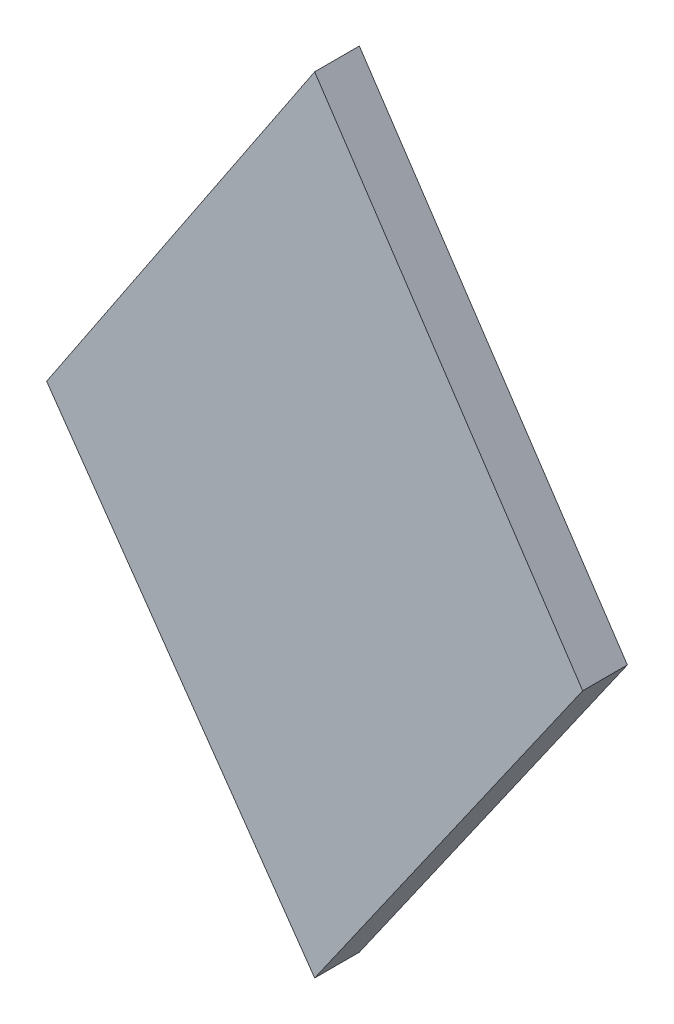
ISO-10303-21;
HEADER;
FILE_DESCRIPTION(('STEP AP214'),'2;1');
FILE_NAME('part.step','',(''),(''),'','','');
FILE_SCHEMA(('AUTOMOTIVE_DESIGN { 1 0 10303 214 1 1 1 1 }'));
ENDSEC;
DATA;
#1=APPLICATION_CONTEXT('core data for automotive mechanical design processes');
#2=APPLICATION_PROTOCOL_DEFINITION('international standard','automotive_design',2000,#1);
#3=PRODUCT_CONTEXT('',#1,'mechanical');
#4=PRODUCT('Part','Part','',(#3));
#5=PRODUCT_RELATED_PRODUCT_CATEGORY('part','',(#4));
#6=PRODUCT_DEFINITION_FORMATION('','',#4);
#7=PRODUCT_DEFINITION_CONTEXT('part definition',#1,'design');
#8=PRODUCT_DEFINITION('design','',#6,#7);
#9=PRODUCT_DEFINITION_SHAPE('','',#8);
#10=(LENGTH_UNIT() NAMED_UNIT(*) SI_UNIT(.MILLI.,.METRE.));
#11=(NAMED_UNIT(*) PLANE_ANGLE_UNIT() SI_UNIT($,.RADIAN.));
#12=(NAMED_UNIT(*) SI_UNIT($,.STERADIAN.) SOLID_ANGLE_UNIT());
#13=UNCERTAINTY_MEASURE_WITH_UNIT(LENGTH_MEASURE(1.E-05),#10,'distance_accuracy_value','');
#14=(GEOMETRIC_REPRESENTATION_CONTEXT(3) GLOBAL_UNCERTAINTY_ASSIGNED_CONTEXT((#13)) GLOBAL_UNIT_ASSIGNED_CONTEXT((#10,
#11,#12)) REPRESENTATION_CONTEXT('',''));
#15=CARTESIAN_POINT('',(0.,0.,0.));
#16=DIRECTION('',(0.,0.,1.));
#17=DIRECTION('',(1.,0.,0.));
#18=AXIS2_PLACEMENT_3D('',#15,#16,#17);
#19=CARTESIAN_POINT('',(-30.,0.,5.));
#20=DIRECTION('',(0.832050294337844,-0.554700196225229,0.));
#21=DIRECTION('',(0.554700196225229,0.832050294337844,0.));
#22=AXIS2_PLACEMENT_3D('',#19,#20,#21);
#23=PLANE('',#22);
#24=DIRECTION('',(-0.554700196225229,-0.832050294337844,0.));
#25=VECTOR('',#24,1.);
#26=CARTESIAN_POINT('',(-30.,0.,0.));
#27=LINE('',#26,#25);
#28=CARTESIAN_POINT('',(0.,45.,0.));
#29=VERTEX_POINT('',#28);
#30=CARTESIAN_POINT('',(-30.,0.,0.));
#31=VERTEX_POINT('',#30);
#32=EDGE_CURVE('E96',#29,#31,#27,.T.);
#33=ORIENTED_EDGE('',*,*,#32,.T.);
#34=DIRECTION('',(0.,0.,-1.));
#35=VECTOR('',#34,1.);
#36=CARTESIAN_POINT('',(-30.,0.,5.));
#37=LINE('',#36,#35);
#38=CARTESIAN_POINT('',(-30.,0.,5.));
#39=VERTEX_POINT('',#38);
#40=EDGE_CURVE('E11',#39,#31,#37,.T.);
#41=ORIENTED_EDGE('',*,*,#40,.F.);
#42=DIRECTION('',(-0.554700196225229,-0.832050294337844,0.));
#43=VECTOR('',#42,1.);
#44=CARTESIAN_POINT('',(-30.,0.,5.));
#45=LINE('',#44,#43);
#46=CARTESIAN_POINT('',(0.,45.,5.));
#47=VERTEX_POINT('',#46);
#48=EDGE_CURVE('E84',#47,#39,#45,.T.);
#49=ORIENTED_EDGE('',*,*,#48,.F.);
#50=DIRECTION('',(0.,0.,-1.));
#51=VECTOR('',#50,1.);
#52=CARTESIAN_POINT('',(0.,45.,5.));
#53=LINE('',#52,#51);
#54=EDGE_CURVE('E92',#47,#29,#53,.T.);
#55=ORIENTED_EDGE('',*,*,#54,.T.);
#56=EDGE_LOOP('',(#33,#41,#49,#55));
#57=FACE_BOUND('',#56,.T.);
#58=ADVANCED_FACE('F33',(#57),#23,.F.);
#59=CARTESIAN_POINT('',(0.,-42.8444402022637,5.));
#60=DIRECTION('',(0.819152044288993,0.573576436351044,0.));
#61=DIRECTION('',(-0.573576436351044,0.819152044288993,0.));
#62=AXIS2_PLACEMENT_3D('',#59,#60,#61);
#63=PLANE('',#62);
#64=DIRECTION('',(0.573576436351044,-0.819152044288993,0.));
#65=VECTOR('',#64,1.);
#66=CARTESIAN_POINT('',(0.,-42.8444402022637,0.));
#67=LINE('',#66,#65);
#68=CARTESIAN_POINT('',(0.,-42.8444402022637,0.));
#69=VERTEX_POINT('',#68);
#70=EDGE_CURVE('E88',#31,#69,#67,.T.);
#71=ORIENTED_EDGE('',*,*,#70,.T.);
#72=DIRECTION('',(0.,0.,-1.));
#73=VECTOR('',#72,1.);
#74=CARTESIAN_POINT('',(0.,-42.8444402022637,5.));
#75=LINE('',#74,#73);
#76=CARTESIAN_POINT('',(0.,-42.8444402022637,5.));
#77=VERTEX_POINT('',#76);
#78=EDGE_CURVE('E41',#77,#69,#75,.T.);
#79=ORIENTED_EDGE('',*,*,#78,.F.);
#80=DIRECTION('',(0.573576436351044,-0.819152044288993,0.));
#81=VECTOR('',#80,1.);
#82=CARTESIAN_POINT('',(0.,-42.8444402022637,5.));
#83=LINE('',#82,#81);
#84=EDGE_CURVE('E79',#39,#77,#83,.T.);
#85=ORIENTED_EDGE('',*,*,#84,.F.);
#86=ORIENTED_EDGE('',*,*,#40,.T.);
#87=EDGE_LOOP('',(#71,#79,#85,#86));
#88=FACE_BOUND('',#87,.T.);
#89=ADVANCED_FACE('F87',(#88),#63,.F.);
#90=CARTESIAN_POINT('',(30.,0.,5.));
#91=DIRECTION('',(-0.819152044288993,0.573576436351044,0.));
#92=DIRECTION('',(-0.573576436351044,-0.819152044288993,0.));
#93=AXIS2_PLACEMENT_3D('',#90,#91,#92);
#94=PLANE('',#93);
#95=DIRECTION('',(0.573576436351044,0.819152044288993,0.));
#96=VECTOR('',#95,1.);
#97=CARTESIAN_POINT('',(30.,0.,0.));
#98=LINE('',#97,#96);
#99=CARTESIAN_POINT('',(30.,0.,0.));
#100=VERTEX_POINT('',#99);
#101=EDGE_CURVE('E66',#69,#100,#98,.T.);
#102=ORIENTED_EDGE('',*,*,#101,.T.);
#103=DIRECTION('',(0.,0.,-1.));
#104=VECTOR('',#103,1.);
#105=CARTESIAN_POINT('',(30.,0.,5.));
#106=LINE('',#105,#104);
#107=CARTESIAN_POINT('',(30.,0.,5.));
#108=VERTEX_POINT('',#107);
#109=EDGE_CURVE('E89',#108,#100,#106,.T.);
#110=ORIENTED_EDGE('',*,*,#109,.F.);
#111=DIRECTION('',(0.573576436351044,0.819152044288993,0.));
#112=VECTOR('',#111,1.);
#113=CARTESIAN_POINT('',(30.,0.,5.));
#114=LINE('',#113,#112);
#115=EDGE_CURVE('E82',#77,#108,#114,.T.);
#116=ORIENTED_EDGE('',*,*,#115,.F.);
#117=ORIENTED_EDGE('',*,*,#78,.T.);
#118=EDGE_LOOP('',(#102,#110,#116,#117));
#119=FACE_BOUND('',#118,.T.);
#120=ADVANCED_FACE('F90',(#119),#94,.F.);
#121=CARTESIAN_POINT('',(0.,45.,5.));
#122=DIRECTION('',(-0.832050294337844,-0.554700196225229,0.));
#123=DIRECTION('',(0.554700196225229,-0.832050294337844,0.));
#124=AXIS2_PLACEMENT_3D('',#121,#122,#123);
#125=PLANE('',#124);
#126=DIRECTION('',(-0.554700196225229,0.832050294337844,0.));
#127=VECTOR('',#126,1.);
#128=CARTESIAN_POINT('',(0.,45.,0.));
#129=LINE('',#128,#127);
#130=EDGE_CURVE('E72',#100,#29,#129,.T.);
#131=ORIENTED_EDGE('',*,*,#130,.T.);
#132=ORIENTED_EDGE('',*,*,#54,.F.);
#133=DIRECTION('',(-0.554700196225229,0.832050294337844,0.));
#134=VECTOR('',#133,1.);
#135=CARTESIAN_POINT('',(0.,45.,5.));
#136=LINE('',#135,#134);
#137=EDGE_CURVE('E49',#108,#47,#136,.T.);
#138=ORIENTED_EDGE('',*,*,#137,.F.);
#139=ORIENTED_EDGE('',*,*,#109,.T.);
#140=EDGE_LOOP('',(#131,#132,#138,#139));
#141=FACE_BOUND('',#140,.T.);
#142=ADVANCED_FACE('F103',(#141),#125,.F.);
#143=CARTESIAN_POINT('',(0.,0.,5.));
#144=DIRECTION('',(0.,0.,1.));
#145=DIRECTION('',(1.,0.,0.));
#146=AXIS2_PLACEMENT_3D('',#143,#144,#145);
#147=PLANE('',#146);
#148=ORIENTED_EDGE('',*,*,#48,.T.);
#149=ORIENTED_EDGE('',*,*,#84,.T.);
#150=ORIENTED_EDGE('',*,*,#115,.T.);
#151=ORIENTED_EDGE('',*,*,#137,.T.);
#152=EDGE_LOOP('',(#148,#149,#150,#151));
#153=FACE_BOUND('',#152,.T.);
#154=ADVANCED_FACE('F80',(#153),#147,.T.);
#155=CARTESIAN_POINT('',(0.,0.,0.));
#156=DIRECTION('',(0.,0.,1.));
#157=DIRECTION('',(1.,0.,0.));
#158=AXIS2_PLACEMENT_3D('',#155,#156,#157);
#159=PLANE('',#158);
#160=ORIENTED_EDGE('',*,*,#32,.F.);
#161=ORIENTED_EDGE('',*,*,#130,.F.);
#162=ORIENTED_EDGE('',*,*,#101,.F.);
#163=ORIENTED_EDGE('',*,*,#70,.F.);
#164=EDGE_LOOP('',(#160,#161,#162,#163));
#165=FACE_BOUND('',#164,.T.);
#166=ADVANCED_FACE('F106',(#165),#159,.F.);
#167=CLOSED_SHELL('',(#58,#89,#120,#142,#154,#166));
#168=MANIFOLD_SOLID_BREP('B2',#167);
#169=ADVANCED_BREP_SHAPE_REPRESENTATION('',(#18,#168),#14);
#170=SHAPE_DEFINITION_REPRESENTATION(#9,#169);
ENDSEC;
END-ISO-10303-21;
